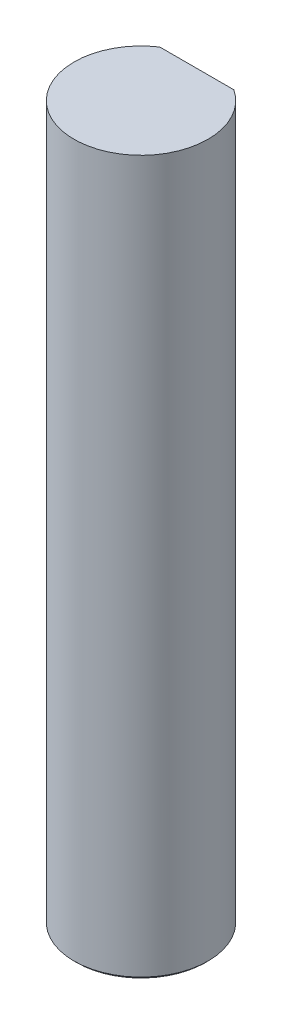
ISO-10303-21;
HEADER;
FILE_DESCRIPTION(('STEP AP214'),'2;1');
FILE_NAME('part.step','',(''),(''),'','','');
FILE_SCHEMA(('AUTOMOTIVE_DESIGN { 1 0 10303 214 1 1 1 1 }'));
ENDSEC;
DATA;
#1=APPLICATION_CONTEXT('core data for automotive mechanical design processes');
#2=APPLICATION_PROTOCOL_DEFINITION('international standard','automotive_design',2000,#1);
#3=PRODUCT_CONTEXT('',#1,'mechanical');
#4=PRODUCT('Part','Part','',(#3));
#5=PRODUCT_RELATED_PRODUCT_CATEGORY('part','',(#4));
#6=PRODUCT_DEFINITION_FORMATION('','',#4);
#7=PRODUCT_DEFINITION_CONTEXT('part definition',#1,'design');
#8=PRODUCT_DEFINITION('design','',#6,#7);
#9=PRODUCT_DEFINITION_SHAPE('','',#8);
#10=(LENGTH_UNIT() NAMED_UNIT(*) SI_UNIT(.MILLI.,.METRE.));
#11=(NAMED_UNIT(*) PLANE_ANGLE_UNIT() SI_UNIT($,.RADIAN.));
#12=(NAMED_UNIT(*) SI_UNIT($,.STERADIAN.) SOLID_ANGLE_UNIT());
#13=UNCERTAINTY_MEASURE_WITH_UNIT(LENGTH_MEASURE(1.E-05),#10,'distance_accuracy_value','');
#14=(GEOMETRIC_REPRESENTATION_CONTEXT(3) GLOBAL_UNCERTAINTY_ASSIGNED_CONTEXT((#13)) GLOBAL_UNIT_ASSIGNED_CONTEXT((#10,
#11,#12)) REPRESENTATION_CONTEXT('',''));
#15=CARTESIAN_POINT('',(0.,0.,0.));
#16=DIRECTION('',(0.,0.,1.));
#17=DIRECTION('',(1.,0.,0.));
#18=AXIS2_PLACEMENT_3D('',#15,#16,#17);
#19=CARTESIAN_POINT('',(0.,90.,-2.5));
#20=DIRECTION('',(0.,0.,-1.));
#21=DIRECTION('',(0.,-1.,0.));
#22=AXIS2_PLACEMENT_3D('',#19,#20,#21);
#23=PLANE('',#22);
#24=DIRECTION('',(0.,-1.,0.));
#25=VECTOR('',#24,1.);
#26=CARTESIAN_POINT('',(-1.6583123951777,90.,-2.5));
#27=LINE('',#26,#25);
#28=CARTESIAN_POINT('',(-1.6583123951777,32.,-2.5));
#29=VERTEX_POINT('',#28);
#30=CARTESIAN_POINT('',(-1.6583123951777,0.125000000000083,-2.5));
#31=VERTEX_POINT('',#30);
#32=EDGE_CURVE('E101',#29,#31,#27,.T.);
#33=ORIENTED_EDGE('',*,*,#32,.F.);
#34=DIRECTION('',(1.,0.,0.));
#35=VECTOR('',#34,1.);
#36=CARTESIAN_POINT('',(0.,32.,-2.5));
#37=LINE('',#36,#35);
#38=CARTESIAN_POINT('',(1.6583123951777,32.,-2.5));
#39=VERTEX_POINT('',#38);
#40=EDGE_CURVE('E61',#29,#39,#37,.T.);
#41=ORIENTED_EDGE('',*,*,#40,.T.);
#42=DIRECTION('',(0.,-1.,0.));
#43=VECTOR('',#42,1.);
#44=CARTESIAN_POINT('',(1.6583123951777,90.,-2.5));
#45=LINE('',#44,#43);
#46=CARTESIAN_POINT('',(1.6583123951777,0.125000000000083,-2.5));
#47=VERTEX_POINT('',#46);
#48=EDGE_CURVE('E99',#39,#47,#45,.T.);
#49=ORIENTED_EDGE('',*,*,#48,.T.);
#50=CARTESIAN_POINT('',(1.6583123951777,0.125000000000083,-2.5));
#51=CARTESIAN_POINT('',(1.57973572193472,0.0815651095965014,-2.5));
#52=CARTESIAN_POINT('',(1.50022900034232,0.0397533035352935,-2.5));
#53=CARTESIAN_POINT('',(1.41972708644996,0.,-2.5));
#54=(BOUNDED_CURVE() B_SPLINE_CURVE(3,(#50,#51,#52,#53),.UNSPECIFIED.,.F.,
.F.) B_SPLINE_CURVE_WITH_KNOTS((4,4),(0.,0.000269347265701222),
.UNSPECIFIED.) CURVE() GEOMETRIC_REPRESENTATION_ITEM() RATIONAL_B_SPLINE_CURVE((1.,1.,1.,1.)) REPRESENTATION_ITEM(''));
#55=CARTESIAN_POINT('',(1.41972708644996,0.,-2.5));
#56=VERTEX_POINT('',#55);
#57=EDGE_CURVE('E109',#47,#56,#54,.T.);
#58=ORIENTED_EDGE('',*,*,#57,.T.);
#59=DIRECTION('',(1.,0.,0.));
#60=VECTOR('',#59,1.);
#61=CARTESIAN_POINT('',(0.,0.,-2.5));
#62=LINE('',#61,#60);
#63=CARTESIAN_POINT('',(-1.41972708644996,0.,-2.5));
#64=VERTEX_POINT('',#63);
#65=EDGE_CURVE('E115',#64,#56,#62,.T.);
#66=ORIENTED_EDGE('',*,*,#65,.F.);
#67=CARTESIAN_POINT('',(-1.41972708644996,0.,-2.5));
#68=CARTESIAN_POINT('',(-1.50022900034231,0.0397533035353176,-2.5));
#69=CARTESIAN_POINT('',(-1.57973572193473,0.0815651095964891,-2.5));
#70=CARTESIAN_POINT('',(-1.6583123951777,0.125000000000083,-2.5));
#71=(BOUNDED_CURVE() B_SPLINE_CURVE(3,(#67,#68,#69,#70),.UNSPECIFIED.,.F.,
.F.) B_SPLINE_CURVE_WITH_KNOTS((4,4),(0.,0.000269347265701236),
.UNSPECIFIED.) CURVE() GEOMETRIC_REPRESENTATION_ITEM() RATIONAL_B_SPLINE_CURVE((1.,1.,1.,1.)) REPRESENTATION_ITEM(''));
#72=EDGE_CURVE('E139',#64,#31,#71,.T.);
#73=ORIENTED_EDGE('',*,*,#72,.T.);
#74=EDGE_LOOP('',(#33,#41,#49,#58,#66,#73));
#75=FACE_BOUND('',#74,.T.);
#76=ADVANCED_FACE('F47',(#75),#23,.T.);
#77=CARTESIAN_POINT('',(0.,90.,0.));
#78=DIRECTION('',(0.,-1.,0.));
#79=DIRECTION('',(0.,0.,-1.));
#80=AXIS2_PLACEMENT_3D('',#77,#78,#79);
#81=CYLINDRICAL_SURFACE('',#80,3.);
#82=ORIENTED_EDGE('',*,*,#48,.F.);
#83=CARTESIAN_POINT('',(0.,32.,0.));
#84=DIRECTION('',(0.,1.,0.));
#85=DIRECTION('',(0.,0.,1.));
#86=AXIS2_PLACEMENT_3D('',#83,#84,#85);
#87=CIRCLE('',#86,3.);
#88=EDGE_CURVE('E11',#39,#29,#87,.F.);
#89=ORIENTED_EDGE('',*,*,#88,.T.);
#90=ORIENTED_EDGE('',*,*,#32,.T.);
#91=CARTESIAN_POINT('',(0.,0.125000000000056,0.));
#92=DIRECTION('',(0.,1.,0.));
#93=DIRECTION('',(0.,0.,1.));
#94=AXIS2_PLACEMENT_3D('',#91,#92,#93);
#95=CIRCLE('',#94,3.);
#96=CARTESIAN_POINT('',(0.,0.125000000000056,3.));
#97=VERTEX_POINT('',#96);
#98=EDGE_CURVE('E135',#31,#97,#95,.T.);
#99=ORIENTED_EDGE('',*,*,#98,.T.);
#100=CARTESIAN_POINT('',(0.,0.125000000000056,0.));
#101=DIRECTION('',(0.,1.,0.));
#102=DIRECTION('',(0.,0.,1.));
#103=AXIS2_PLACEMENT_3D('',#100,#101,#102);
#104=CIRCLE('',#103,3.);
#105=EDGE_CURVE('E107',#97,#47,#104,.T.);
#106=ORIENTED_EDGE('',*,*,#105,.T.);
#107=EDGE_LOOP('',(#82,#89,#90,#99,#106));
#108=FACE_BOUND('',#107,.T.);
#109=ADVANCED_FACE('F105',(#108),#81,.T.);
#110=CARTESIAN_POINT('',(0.,0.125000000000056,0.));
#111=DIRECTION('',(0.,1.,0.));
#112=DIRECTION('',(0.,0.,1.));
#113=AXIS2_PLACEMENT_3D('',#110,#111,#112);
#114=CONICAL_SURFACE('',#113,3.,0.785398163397442);
#115=DIRECTION('',(0.,0.707106781186553,0.707106781186543));
#116=VECTOR('',#115,1.);
#117=CARTESIAN_POINT('',(0.,0.125000000000056,3.));
#118=LINE('',#117,#116);
#119=CARTESIAN_POINT('',(0.,0.,2.87499999999994));
#120=VERTEX_POINT('',#119);
#121=EDGE_CURVE('E131',#120,#97,#118,.T.);
#122=ORIENTED_EDGE('',*,*,#121,.F.);
#123=CARTESIAN_POINT('',(0.,0.,0.));
#124=DIRECTION('',(0.,-1.,0.));
#125=DIRECTION('',(0.,0.,1.));
#126=AXIS2_PLACEMENT_3D('',#123,#124,#125);
#127=CIRCLE('',#126,2.87499999999994);
#128=EDGE_CURVE('E55',#56,#120,#127,.T.);
#129=ORIENTED_EDGE('',*,*,#128,.F.);
#130=ORIENTED_EDGE('',*,*,#57,.F.);
#131=ORIENTED_EDGE('',*,*,#105,.F.);
#132=EDGE_LOOP('',(#122,#129,#130,#131));
#133=FACE_BOUND('',#132,.T.);
#134=ADVANCED_FACE('F49',(#133),#114,.T.);
#135=CARTESIAN_POINT('',(0.,0.,0.));
#136=DIRECTION('',(0.,1.,0.));
#137=DIRECTION('',(1.,0.,0.));
#138=AXIS2_PLACEMENT_3D('',#135,#136,#137);
#139=PLANE('',#138);
#140=ORIENTED_EDGE('',*,*,#65,.T.);
#141=ORIENTED_EDGE('',*,*,#128,.T.);
#142=CARTESIAN_POINT('',(0.,0.,0.));
#143=DIRECTION('',(0.,-1.,0.));
#144=DIRECTION('',(0.,0.,1.));
#145=AXIS2_PLACEMENT_3D('',#142,#143,#144);
#146=CIRCLE('',#145,2.87499999999994);
#147=EDGE_CURVE('E102',#120,#64,#146,.T.);
#148=ORIENTED_EDGE('',*,*,#147,.T.);
#149=EDGE_LOOP('',(#140,#141,#148));
#150=FACE_BOUND('',#149,.T.);
#151=ADVANCED_FACE('F128',(#150),#139,.F.);
#152=CARTESIAN_POINT('',(0.,0.125000000000056,0.));
#153=DIRECTION('',(0.,1.,0.));
#154=DIRECTION('',(0.,0.,1.));
#155=AXIS2_PLACEMENT_3D('',#152,#153,#154);
#156=CONICAL_SURFACE('',#155,3.,0.785398163397442);
#157=ORIENTED_EDGE('',*,*,#147,.F.);
#158=ORIENTED_EDGE('',*,*,#121,.T.);
#159=ORIENTED_EDGE('',*,*,#98,.F.);
#160=ORIENTED_EDGE('',*,*,#72,.F.);
#161=EDGE_LOOP('',(#157,#158,#159,#160));
#162=FACE_BOUND('',#161,.T.);
#163=ADVANCED_FACE('F138',(#162),#156,.T.);
#164=CARTESIAN_POINT('',(0.,32.,0.));
#165=DIRECTION('',(0.,1.,0.));
#166=DIRECTION('',(0.,0.,1.));
#167=AXIS2_PLACEMENT_3D('',#164,#165,#166);
#168=PLANE('',#167);
#169=ORIENTED_EDGE('',*,*,#88,.F.);
#170=ORIENTED_EDGE('',*,*,#40,.F.);
#171=EDGE_LOOP('',(#169,#170));
#172=FACE_BOUND('',#171,.T.);
#173=ADVANCED_FACE('F93',(#172),#168,.T.);
#174=CLOSED_SHELL('',(#76,#109,#134,#151,#163,#173));
#175=MANIFOLD_SOLID_BREP('B2',#174);
#176=ADVANCED_BREP_SHAPE_REPRESENTATION('',(#18,#175),#14);
#177=SHAPE_DEFINITION_REPRESENTATION(#9,#176);
ENDSEC;
END-ISO-10303-21;
